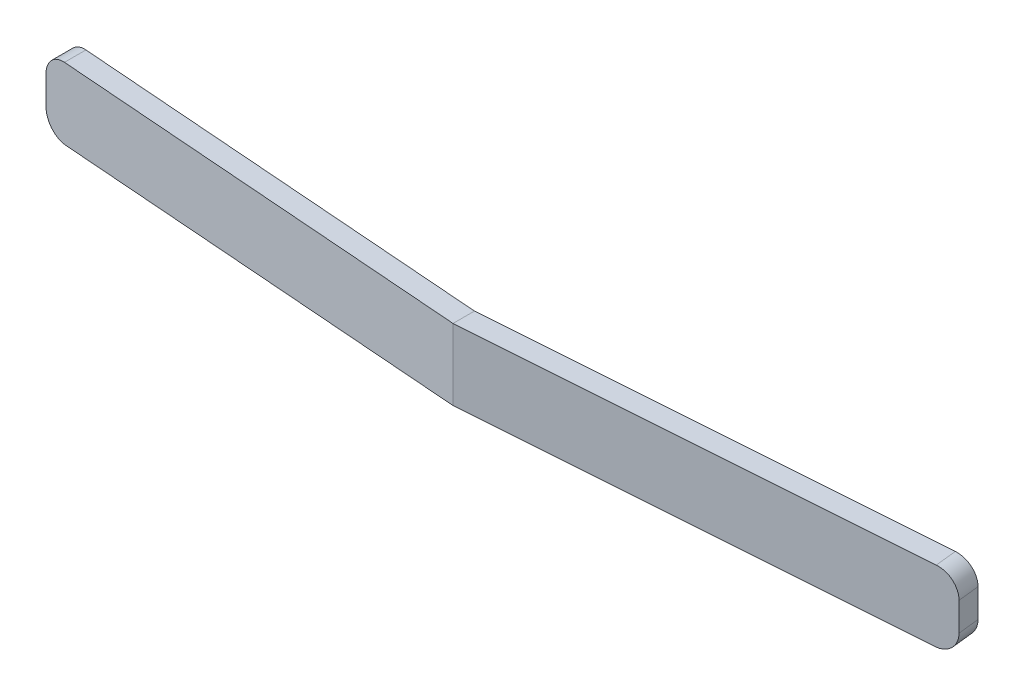
ISO-10303-21;
HEADER;
FILE_DESCRIPTION(('STEP AP214'),'2;1');
FILE_NAME('part.step','',(''),(''),'','','');
FILE_SCHEMA(('AUTOMOTIVE_DESIGN { 1 0 10303 214 1 1 1 1 }'));
ENDSEC;
DATA;
#1=APPLICATION_CONTEXT('core data for automotive mechanical design processes');
#2=APPLICATION_PROTOCOL_DEFINITION('international standard','automotive_design',2000,#1);
#3=PRODUCT_CONTEXT('',#1,'mechanical');
#4=PRODUCT('Part','Part','',(#3));
#5=PRODUCT_RELATED_PRODUCT_CATEGORY('part','',(#4));
#6=PRODUCT_DEFINITION_FORMATION('','',#4);
#7=PRODUCT_DEFINITION_CONTEXT('part definition',#1,'design');
#8=PRODUCT_DEFINITION('design','',#6,#7);
#9=PRODUCT_DEFINITION_SHAPE('','',#8);
#10=(LENGTH_UNIT() NAMED_UNIT(*) SI_UNIT(.MILLI.,.METRE.));
#11=(NAMED_UNIT(*) PLANE_ANGLE_UNIT() SI_UNIT($,.RADIAN.));
#12=(NAMED_UNIT(*) SI_UNIT($,.STERADIAN.) SOLID_ANGLE_UNIT());
#13=UNCERTAINTY_MEASURE_WITH_UNIT(LENGTH_MEASURE(1.E-05),#10,'distance_accuracy_value','');
#14=(GEOMETRIC_REPRESENTATION_CONTEXT(3) GLOBAL_UNCERTAINTY_ASSIGNED_CONTEXT((#13)) GLOBAL_UNIT_ASSIGNED_CONTEXT((#10,
#11,#12)) REPRESENTATION_CONTEXT('',''));
#15=CARTESIAN_POINT('',(0.,0.,0.));
#16=DIRECTION('',(0.,0.,1.));
#17=DIRECTION('',(1.,0.,0.));
#18=AXIS2_PLACEMENT_3D('',#15,#16,#17);
#19=CARTESIAN_POINT('',(64.,20.,-6.78314376242262));
#20=DIRECTION('',(0.105396307433869,0.,0.994430298401706));
#21=DIRECTION('',(0.994430298401706,0.,-0.105396307433869));
#22=AXIS2_PLACEMENT_3D('',#19,#20,#21);
#23=PLANE('',#22);
#24=DIRECTION('',(0.,-1.,0.));
#25=VECTOR('',#24,1.);
#26=CARTESIAN_POINT('',(64.,20.,-6.78314376242262));
#27=LINE('',#26,#25);
#28=CARTESIAN_POINT('',(64.,12.9422994368737,-6.78314376242262));
#29=VERTEX_POINT('',#28);
#30=CARTESIAN_POINT('',(64.,8.94535363178294,-6.78314376242262));
#31=VERTEX_POINT('',#30);
#32=EDGE_CURVE('E163',#29,#31,#27,.T.);
#33=ORIENTED_EDGE('',*,*,#32,.T.);
#34=CARTESIAN_POINT('',(61.0167091047949,8.94535363178294,-6.46695484012101));
#35=DIRECTION('',(0.105396307433869,0.,0.994430298401706));
#36=DIRECTION('',(1.14891176127128E-13,1.,0.));
#37=AXIS2_PLACEMENT_3D('',#34,#35,#36);
#38=ELLIPSE('',#37,3.00001696785082,3.);
#39=CARTESIAN_POINT('',(60.9220871437751,5.94684603375885,-6.4569261781729));
#40=VERTEX_POINT('',#39);
#41=EDGE_CURVE('E209',#31,#40,#38,.F.);
#42=ORIENTED_EDGE('',*,*,#41,.T.);
#43=DIRECTION('',(-0.993929974547117,0.0317174888344262,0.105343279798971));
#44=VECTOR('',#43,1.);
#45=CARTESIAN_POINT('',(63.5538784654523,5.86286243934329,-6.73586084829216));
#46=LINE('',#45,#44);
#47=CARTESIAN_POINT('',(0.,7.8909423667355,0.));
#48=VERTEX_POINT('',#47);
#49=EDGE_CURVE('E141',#40,#48,#46,.T.);
#50=ORIENTED_EDGE('',*,*,#49,.T.);
#51=DIRECTION('',(0.,-1.,0.));
#52=VECTOR('',#51,1.);
#53=CARTESIAN_POINT('',(0.,20.,0.));
#54=LINE('',#53,#52);
#55=CARTESIAN_POINT('',(0.,17.8909423667355,0.));
#56=VERTEX_POINT('',#55);
#57=EDGE_CURVE('E170',#56,#48,#54,.T.);
#58=ORIENTED_EDGE('',*,*,#57,.F.);
#59=DIRECTION('',(0.993929974547117,-0.0317174888344262,-0.105343279798971));
#60=VECTOR('',#59,1.);
#61=CARTESIAN_POINT('',(63.8691280941513,15.8528024483637,-6.76927309130021));
#62=LINE('',#61,#60);
#63=CARTESIAN_POINT('',(61.1113310658147,15.9408070348978,-6.47698350206913));
#64=VERTEX_POINT('',#63);
#65=EDGE_CURVE('E142',#56,#64,#62,.T.);
#66=ORIENTED_EDGE('',*,*,#65,.T.);
#67=CARTESIAN_POINT('',(61.0167091047949,12.9422994368737,-6.46695484012101));
#68=DIRECTION('',(0.105396307433869,0.,0.994430298401706));
#69=DIRECTION('',(-1.14891176127128E-13,-1.,0.));
#70=AXIS2_PLACEMENT_3D('',#67,#68,#69);
#71=ELLIPSE('',#70,3.00001696785082,3.);
#72=EDGE_CURVE('E206',#64,#29,#71,.F.);
#73=ORIENTED_EDGE('',*,*,#72,.T.);
#74=EDGE_LOOP('',(#33,#42,#50,#58,#66,#73));
#75=FACE_BOUND('',#74,.T.);
#76=ADVANCED_FACE('F39',(#75),#23,.F.);
#77=CARTESIAN_POINT('',(0.,20.,0.));
#78=DIRECTION('',(-0.105396307433892,0.,0.994430298401703));
#79=DIRECTION('',(0.994430298401703,0.,0.105396307433892));
#80=AXIS2_PLACEMENT_3D('',#77,#78,#79);
#81=PLANE('',#80);
#82=DIRECTION('',(-0.993905324442482,-0.0324892270609227,-0.10534066721769));
#83=VECTOR('',#82,1.);
#84=CARTESIAN_POINT('',(0.391016192720794,7.90372408100686,0.0414424851353265));
#85=LINE('',#84,#83);
#86=CARTESIAN_POINT('',(-60.9019869934581,5.90015065324738,-6.45479583115488));
#87=VERTEX_POINT('',#86);
#88=EDGE_CURVE('E147',#48,#87,#85,.T.);
#89=ORIENTED_EDGE('',*,*,#88,.T.);
#90=CARTESIAN_POINT('',(-61.,8.89854913419494,-6.46518389856053));
#91=DIRECTION('',(-0.105396307433892,0.,0.994430298401703));
#92=DIRECTION('',(-0.994430298401703,0.,-0.105396307433892));
#93=AXIS2_PLACEMENT_3D('',#90,#91,#92);
#94=ELLIPSE('',#93,3.01680269076852,3.);
#95=CARTESIAN_POINT('',(-64.,8.89854913419494,-6.78314376242416));
#96=VERTEX_POINT('',#95);
#97=EDGE_CURVE('E180',#87,#96,#94,.F.);
#98=ORIENTED_EDGE('',*,*,#97,.T.);
#99=DIRECTION('',(0.,-1.,0.));
#100=VECTOR('',#99,1.);
#101=CARTESIAN_POINT('',(-64.,20.,-6.78314376242416));
#102=LINE('',#101,#100);
#103=CARTESIAN_POINT('',(-64.,12.8953443852679,-6.78314376242416));
#104=VERTEX_POINT('',#103);
#105=EDGE_CURVE('E160',#104,#96,#102,.T.);
#106=ORIENTED_EDGE('',*,*,#105,.F.);
#107=CARTESIAN_POINT('',(-61.,12.8953443852679,-6.46518389856053));
#108=DIRECTION('',(-0.105396307433892,0.,0.994430298401703));
#109=DIRECTION('',(-0.994430298401703,0.,-0.105396307433892));
#110=AXIS2_PLACEMENT_3D('',#107,#108,#109);
#111=ELLIPSE('',#110,3.01680269076852,3.);
#112=CARTESIAN_POINT('',(-61.0980130065419,15.8937428662154,-6.47557196596617));
#113=VERTEX_POINT('',#112);
#114=EDGE_CURVE('E177',#104,#113,#111,.F.);
#115=ORIENTED_EDGE('',*,*,#114,.T.);
#116=DIRECTION('',(0.993905324442482,0.0324892270609227,0.10534066721769));
#117=VECTOR('',#116,1.);
#118=CARTESIAN_POINT('',(0.0681040350920758,17.8931685822567,0.00721811657548015));
#119=LINE('',#118,#117);
#120=EDGE_CURVE('E227',#113,#56,#119,.T.);
#121=ORIENTED_EDGE('',*,*,#120,.T.);
#122=ORIENTED_EDGE('',*,*,#57,.T.);
#123=EDGE_LOOP('',(#89,#98,#106,#115,#121,#122));
#124=FACE_BOUND('',#123,.T.);
#125=ADVANCED_FACE('F236',(#124),#81,.F.);
#126=CARTESIAN_POINT('',(-64.,20.,-6.78314376242416));
#127=DIRECTION('',(1.,0.,0.));
#128=DIRECTION('',(0.,0.,-1.));
#129=AXIS2_PLACEMENT_3D('',#126,#127,#128);
#130=PLANE('',#129);
#131=ORIENTED_EDGE('',*,*,#105,.T.);
#132=DIRECTION('',(0.,0.,-1.));
#133=VECTOR('',#132,1.);
#134=CARTESIAN_POINT('',(-64.,8.89854913419494,-6.78314376242416));
#135=LINE('',#134,#133);
#136=CARTESIAN_POINT('',(-64.,8.89854913419494,-3.76634107165565));
#137=VERTEX_POINT('',#136);
#138=EDGE_CURVE('E187',#96,#137,#135,.F.);
#139=ORIENTED_EDGE('',*,*,#138,.T.);
#140=DIRECTION('',(0.,-1.,0.));
#141=VECTOR('',#140,1.);
#142=CARTESIAN_POINT('',(-64.,20.,-3.76634107165565));
#143=LINE('',#142,#141);
#144=CARTESIAN_POINT('',(-64.,12.8953443852679,-3.76634107165565));
#145=VERTEX_POINT('',#144);
#146=EDGE_CURVE('E155',#145,#137,#143,.T.);
#147=ORIENTED_EDGE('',*,*,#146,.F.);
#148=DIRECTION('',(0.,0.,-1.));
#149=VECTOR('',#148,1.);
#150=CARTESIAN_POINT('',(-64.,12.8953443852679,-6.78314376242416));
#151=LINE('',#150,#149);
#152=EDGE_CURVE('E183',#145,#104,#151,.T.);
#153=ORIENTED_EDGE('',*,*,#152,.T.);
#154=EDGE_LOOP('',(#131,#139,#147,#153));
#155=FACE_BOUND('',#154,.T.);
#156=ADVANCED_FACE('F262',(#155),#130,.F.);
#157=CARTESIAN_POINT('',(-64.,20.,-3.76634107165565));
#158=DIRECTION('',(0.105396307433892,0.,-0.994430298401703));
#159=DIRECTION('',(-0.994430298401703,0.,-0.105396307433892));
#160=AXIS2_PLACEMENT_3D('',#157,#158,#159);
#161=PLANE('',#160);
#162=ORIENTED_EDGE('',*,*,#146,.T.);
#163=CARTESIAN_POINT('',(-61.,8.89854913419494,-3.44838120779201));
#164=DIRECTION('',(0.105396307433892,0.,-0.994430298401703));
#165=DIRECTION('',(-0.994430298401703,0.,-0.105396307433892));
#166=AXIS2_PLACEMENT_3D('',#163,#164,#165);
#167=ELLIPSE('',#166,3.01680269076852,3.);
#168=CARTESIAN_POINT('',(-60.9019869934581,5.90015065324738,-3.43799314038637));
#169=VERTEX_POINT('',#168);
#170=EDGE_CURVE('E125',#137,#169,#167,.F.);
#171=ORIENTED_EDGE('',*,*,#170,.T.);
#172=DIRECTION('',(0.993905324442482,0.0324892270609227,0.10534066721769));
#173=VECTOR('',#172,1.);
#174=CARTESIAN_POINT('',(-63.5414286152782,5.8138713909711,-3.71773863996968));
#175=LINE('',#174,#173);
#176=CARTESIAN_POINT('',(0.,7.8909423667355,3.01680269076852));
#177=VERTEX_POINT('',#176);
#178=EDGE_CURVE('E118',#169,#177,#175,.T.);
#179=ORIENTED_EDGE('',*,*,#178,.T.);
#180=DIRECTION('',(0.,-1.,0.));
#181=VECTOR('',#180,1.);
#182=CARTESIAN_POINT('',(0.,20.,3.01680269076852));
#183=LINE('',#182,#181);
#184=CARTESIAN_POINT('',(0.,17.8909423667355,3.01680269076852));
#185=VERTEX_POINT('',#184);
#186=EDGE_CURVE('E123',#185,#177,#183,.T.);
#187=ORIENTED_EDGE('',*,*,#186,.F.);
#188=DIRECTION('',(-0.993905324442482,-0.0324892270609227,-0.10534066721769));
#189=VECTOR('',#188,1.);
#190=CARTESIAN_POINT('',(-63.8643407729069,15.8033158922209,-3.75196300852952));
#191=LINE('',#190,#189);
#192=CARTESIAN_POINT('',(-61.0980130065419,15.8937428662154,-3.45876927519766));
#193=VERTEX_POINT('',#192);
#194=EDGE_CURVE('E132',#185,#193,#191,.T.);
#195=ORIENTED_EDGE('',*,*,#194,.T.);
#196=CARTESIAN_POINT('',(-61.,12.8953443852679,-3.44838120779202));
#197=DIRECTION('',(0.105396307433892,0.,-0.994430298401703));
#198=DIRECTION('',(-0.994430298401703,0.,-0.105396307433892));
#199=AXIS2_PLACEMENT_3D('',#196,#197,#198);
#200=ELLIPSE('',#199,3.01680269076852,3.);
#201=EDGE_CURVE('E190',#193,#145,#200,.F.);
#202=ORIENTED_EDGE('',*,*,#201,.T.);
#203=EDGE_LOOP('',(#162,#171,#179,#187,#195,#202));
#204=FACE_BOUND('',#203,.T.);
#205=ADVANCED_FACE('F120',(#204),#161,.F.);
#206=CARTESIAN_POINT('',(0.,20.,3.01680269076852));
#207=DIRECTION('',(-0.105396307433869,0.,-0.994430298401706));
#208=DIRECTION('',(-0.994430298401706,0.,0.105396307433869));
#209=AXIS2_PLACEMENT_3D('',#206,#207,#208);
#210=PLANE('',#209);
#211=DIRECTION('',(0.993929974547117,-0.0317174888344262,-0.105343279798971));
#212=VECTOR('',#211,1.);
#213=CARTESIAN_POINT('',(-0.381737592278135,7.90312406779174,3.05726176839264));
#214=LINE('',#213,#212);
#215=CARTESIAN_POINT('',(61.2382760660767,5.93675606880208,-3.47363528296778));
#216=VERTEX_POINT('',#215);
#217=EDGE_CURVE('E135',#177,#216,#214,.T.);
#218=ORIENTED_EDGE('',*,*,#217,.T.);
#219=CARTESIAN_POINT('',(61.3328980270965,8.93526366682616,-3.48366394491589));
#220=DIRECTION('',(-0.105396307433869,0.,-0.994430298401706));
#221=DIRECTION('',(1.35407457578401E-13,1.,0.));
#222=AXIS2_PLACEMENT_3D('',#219,#220,#221);
#223=ELLIPSE('',#222,3.00001696785082,3.);
#224=CARTESIAN_POINT('',(64.3161889223016,8.93526366682616,-3.7998528672175));
#225=VERTEX_POINT('',#224);
#226=EDGE_CURVE('E48',#216,#225,#223,.F.);
#227=ORIENTED_EDGE('',*,*,#226,.T.);
#228=DIRECTION('',(0.,-1.,0.));
#229=VECTOR('',#228,1.);
#230=CARTESIAN_POINT('',(64.3161889223016,20.,-3.7998528672175));
#231=LINE('',#230,#229);
#232=CARTESIAN_POINT('',(64.3161889223016,12.9322094719169,-3.7998528672175));
#233=VERTEX_POINT('',#232);
#234=EDGE_CURVE('E156',#233,#225,#231,.T.);
#235=ORIENTED_EDGE('',*,*,#234,.F.);
#236=CARTESIAN_POINT('',(61.3328980270965,12.9322094719169,-3.48366394491589));
#237=DIRECTION('',(-0.105396307433869,0.,-0.994430298401706));
#238=DIRECTION('',(-1.35407457578401E-13,-1.,0.));
#239=AXIS2_PLACEMENT_3D('',#236,#237,#238);
#240=ELLIPSE('',#239,3.00001696785082,3.);
#241=CARTESIAN_POINT('',(61.4275199881163,15.930717069941,-3.49369260686401));
#242=VERTEX_POINT('',#241);
#243=EDGE_CURVE('E55',#233,#242,#240,.F.);
#244=ORIENTED_EDGE('',*,*,#243,.T.);
#245=DIRECTION('',(-0.993929974547117,0.0317174888344262,0.105343279798971));
#246=VECTOR('',#245,1.);
#247=CARTESIAN_POINT('',(-0.0664879635791376,17.8930640768121,3.02384952538458));
#248=LINE('',#247,#246);
#249=EDGE_CURVE('E149',#242,#185,#248,.T.);
#250=ORIENTED_EDGE('',*,*,#249,.T.);
#251=ORIENTED_EDGE('',*,*,#186,.T.);
#252=EDGE_LOOP('',(#218,#227,#235,#244,#250,#251));
#253=FACE_BOUND('',#252,.T.);
#254=ADVANCED_FACE('F152',(#253),#210,.F.);
#255=CARTESIAN_POINT('',(64.3161889223016,20.,-3.7998528672175));
#256=DIRECTION('',(-0.994430298401706,0.,0.105396307433868));
#257=DIRECTION('',(0.105396307433868,0.,0.994430298401706));
#258=AXIS2_PLACEMENT_3D('',#255,#256,#257);
#259=PLANE('',#258);
#260=ORIENTED_EDGE('',*,*,#234,.T.);
#261=DIRECTION('',(-0.105395711320966,0.00336330262958648,-0.994424673985199));
#262=VECTOR('',#261,1.);
#263=CARTESIAN_POINT('',(64.3122667203135,8.93538882896127,-3.83685944352352));
#264=LINE('',#263,#262);
#265=EDGE_CURVE('E202',#225,#31,#264,.T.);
#266=ORIENTED_EDGE('',*,*,#265,.T.);
#267=ORIENTED_EDGE('',*,*,#32,.F.);
#268=DIRECTION('',(0.105395711320966,-0.00336330262958648,0.994424673985199));
#269=VECTOR('',#268,1.);
#270=CARTESIAN_POINT('',(64.3136835483617,12.9322894213822,-3.82349145395077));
#271=LINE('',#270,#269);
#272=EDGE_CURVE('E198',#29,#233,#271,.T.);
#273=ORIENTED_EDGE('',*,*,#272,.T.);
#274=EDGE_LOOP('',(#260,#266,#267,#273));
#275=FACE_BOUND('',#274,.T.);
#276=ADVANCED_FACE('F219',(#275),#259,.F.);
#277=CARTESIAN_POINT('',(-0.584202979765229,17.871845675338,3.01680269076852));
#278=DIRECTION('',(0.0326710021806403,-0.999466160315852,0.));
#279=DIRECTION('',(0.999466160315852,0.0326710021806403,0.));
#280=AXIS2_PLACEMENT_3D('',#277,#278,#279);
#281=PLANE('',#280);
#282=ORIENTED_EDGE('',*,*,#120,.F.);
#283=DIRECTION('',(0.,0.,-1.));
#284=VECTOR('',#283,1.);
#285=CARTESIAN_POINT('',(-61.0980130065419,15.8937428662154,3.01680269076852));
#286=LINE('',#285,#284);
#287=EDGE_CURVE('E195',#113,#193,#286,.F.);
#288=ORIENTED_EDGE('',*,*,#287,.T.);
#289=ORIENTED_EDGE('',*,*,#194,.F.);
#290=DIRECTION('',(0.,0.,-1.));
#291=VECTOR('',#290,1.);
#292=CARTESIAN_POINT('',(0.,17.8909423667355,3.01680269076852));
#293=LINE('',#292,#291);
#294=EDGE_CURVE('E150',#185,#56,#293,.T.);
#295=ORIENTED_EDGE('',*,*,#294,.T.);
#296=EDGE_LOOP('',(#282,#288,#289,#295));
#297=FACE_BOUND('',#296,.T.);
#298=ADVANCED_FACE('F254',(#297),#281,.F.);
#299=CARTESIAN_POINT('',(0.570340479956591,17.8727421229879,3.01680269076852));
#300=DIRECTION('',(-0.0318949550052375,-0.999491226497368,0.));
#301=DIRECTION('',(0.999491226497369,-0.0318949550052375,0.));
#302=AXIS2_PLACEMENT_3D('',#299,#300,#301);
#303=PLANE('',#302);
#304=ORIENTED_EDGE('',*,*,#249,.F.);
#305=DIRECTION('',(0.105395711320966,-0.00336330262958648,0.994424673985199));
#306=VECTOR('',#305,1.);
#307=CARTESIAN_POINT('',(61.433167071633,15.9305368647827,-3.44041150923034));
#308=LINE('',#307,#306);
#309=EDGE_CURVE('E11',#242,#64,#308,.F.);
#310=ORIENTED_EDGE('',*,*,#309,.T.);
#311=ORIENTED_EDGE('',*,*,#65,.F.);
#312=ORIENTED_EDGE('',*,*,#294,.F.);
#313=EDGE_LOOP('',(#304,#310,#311,#312));
#314=FACE_BOUND('',#313,.T.);
#315=ADVANCED_FACE('F248',(#314),#303,.F.);
#316=CARTESIAN_POINT('',(-0.257667368733675,7.88251961917283,3.01680269076852));
#317=DIRECTION('',(-0.0326710021806402,0.999466160315852,0.));
#318=DIRECTION('',(-0.999466160315852,-0.0326710021806402,0.));
#319=AXIS2_PLACEMENT_3D('',#316,#317,#318);
#320=PLANE('',#319);
#321=ORIENTED_EDGE('',*,*,#178,.F.);
#322=DIRECTION('',(0.,0.,-1.));
#323=VECTOR('',#322,1.);
#324=CARTESIAN_POINT('',(-60.9019869934581,5.90015065324738,3.01680269076852));
#325=LINE('',#324,#323);
#326=EDGE_CURVE('E131',#169,#87,#325,.T.);
#327=ORIENTED_EDGE('',*,*,#326,.T.);
#328=ORIENTED_EDGE('',*,*,#88,.F.);
#329=DIRECTION('',(0.,0.,-1.));
#330=VECTOR('',#329,1.);
#331=CARTESIAN_POINT('',(0.,7.8909423667355,3.01680269076852));
#332=LINE('',#331,#330);
#333=EDGE_CURVE('E137',#177,#48,#332,.T.);
#334=ORIENTED_EDGE('',*,*,#333,.F.);
#335=EDGE_LOOP('',(#321,#327,#328,#334));
#336=FACE_BOUND('',#335,.T.);
#337=ADVANCED_FACE('F145',(#336),#320,.F.);
#338=CARTESIAN_POINT('',(0.251553202983959,7.88291500453572,3.01680269076852));
#339=DIRECTION('',(0.0318949550052375,0.999491226497368,0.));
#340=DIRECTION('',(-0.999491226497369,0.0318949550052376,0.));
#341=AXIS2_PLACEMENT_3D('',#338,#339,#340);
#342=PLANE('',#341);
#343=ORIENTED_EDGE('',*,*,#49,.F.);
#344=DIRECTION('',(-0.105395711320966,0.00336330262958648,-0.994424673985199));
#345=VECTOR('',#344,1.);
#346=CARTESIAN_POINT('',(61.2403805135533,5.9366889133776,-3.45377949880309));
#347=LINE('',#346,#345);
#348=EDGE_CURVE('E63',#40,#216,#347,.F.);
#349=ORIENTED_EDGE('',*,*,#348,.T.);
#350=ORIENTED_EDGE('',*,*,#217,.F.);
#351=ORIENTED_EDGE('',*,*,#333,.T.);
#352=EDGE_LOOP('',(#343,#349,#350,#351));
#353=FACE_BOUND('',#352,.T.);
#354=ADVANCED_FACE('F136',(#353),#342,.F.);
#355=CARTESIAN_POINT('',(-61.,8.89854913419494,3.01680269076852));
#356=DIRECTION('',(0.,0.,-1.));
#357=DIRECTION('',(-1.,0.,0.));
#358=AXIS2_PLACEMENT_3D('',#355,#356,#357);
#359=CYLINDRICAL_SURFACE('',#358,3.);
#360=ORIENTED_EDGE('',*,*,#170,.F.);
#361=ORIENTED_EDGE('',*,*,#138,.F.);
#362=ORIENTED_EDGE('',*,*,#97,.F.);
#363=ORIENTED_EDGE('',*,*,#326,.F.);
#364=EDGE_LOOP('',(#360,#361,#362,#363));
#365=FACE_BOUND('',#364,.T.);
#366=ADVANCED_FACE('F265',(#365),#359,.T.);
#367=CARTESIAN_POINT('',(-61.,12.8953443852679,-6.78314376242416));
#368=DIRECTION('',(0.,0.,-1.));
#369=DIRECTION('',(-1.,0.,0.));
#370=AXIS2_PLACEMENT_3D('',#367,#368,#369);
#371=CYLINDRICAL_SURFACE('',#370,3.);
#372=ORIENTED_EDGE('',*,*,#201,.F.);
#373=ORIENTED_EDGE('',*,*,#287,.F.);
#374=ORIENTED_EDGE('',*,*,#114,.F.);
#375=ORIENTED_EDGE('',*,*,#152,.F.);
#376=EDGE_LOOP('',(#372,#373,#374,#375));
#377=FACE_BOUND('',#376,.T.);
#378=ADVANCED_FACE('F260',(#377),#371,.T.);
#379=CARTESIAN_POINT('',(61.3289758251084,8.93538882896127,-3.52067052122192));
#380=DIRECTION('',(-0.105395711320966,0.00336330262958648,-0.994424673985199));
#381=DIRECTION('',(-0.994430298401706,0.,0.105396307433868));
#382=AXIS2_PLACEMENT_3D('',#379,#380,#381);
#383=CYLINDRICAL_SURFACE('',#382,3.);
#384=ORIENTED_EDGE('',*,*,#226,.F.);
#385=ORIENTED_EDGE('',*,*,#348,.F.);
#386=ORIENTED_EDGE('',*,*,#41,.F.);
#387=ORIENTED_EDGE('',*,*,#265,.F.);
#388=EDGE_LOOP('',(#384,#385,#386,#387));
#389=FACE_BOUND('',#388,.T.);
#390=ADVANCED_FACE('F223',(#389),#383,.T.);
#391=CARTESIAN_POINT('',(61.3303926531566,12.9322894213822,-3.50730253164917));
#392=DIRECTION('',(0.105395711320966,-0.00336330262958648,0.994424673985199));
#393=DIRECTION('',(0.994430298401706,0.,-0.105396307433868));
#394=AXIS2_PLACEMENT_3D('',#391,#392,#393);
#395=CYLINDRICAL_SURFACE('',#394,3.);
#396=ORIENTED_EDGE('',*,*,#72,.F.);
#397=ORIENTED_EDGE('',*,*,#309,.F.);
#398=ORIENTED_EDGE('',*,*,#243,.F.);
#399=ORIENTED_EDGE('',*,*,#272,.F.);
#400=EDGE_LOOP('',(#396,#397,#398,#399));
#401=FACE_BOUND('',#400,.T.);
#402=ADVANCED_FACE('F41',(#401),#395,.T.);
#403=CLOSED_SHELL('',(#76,#125,#156,#205,#254,#276,#298,#315,#337,#354,#366,#378,#390,#402));
#404=MANIFOLD_SOLID_BREP('B2',#403);
#405=ADVANCED_BREP_SHAPE_REPRESENTATION('',(#18,#404),#14);
#406=SHAPE_DEFINITION_REPRESENTATION(#9,#405);
ENDSEC;
END-ISO-10303-21;
